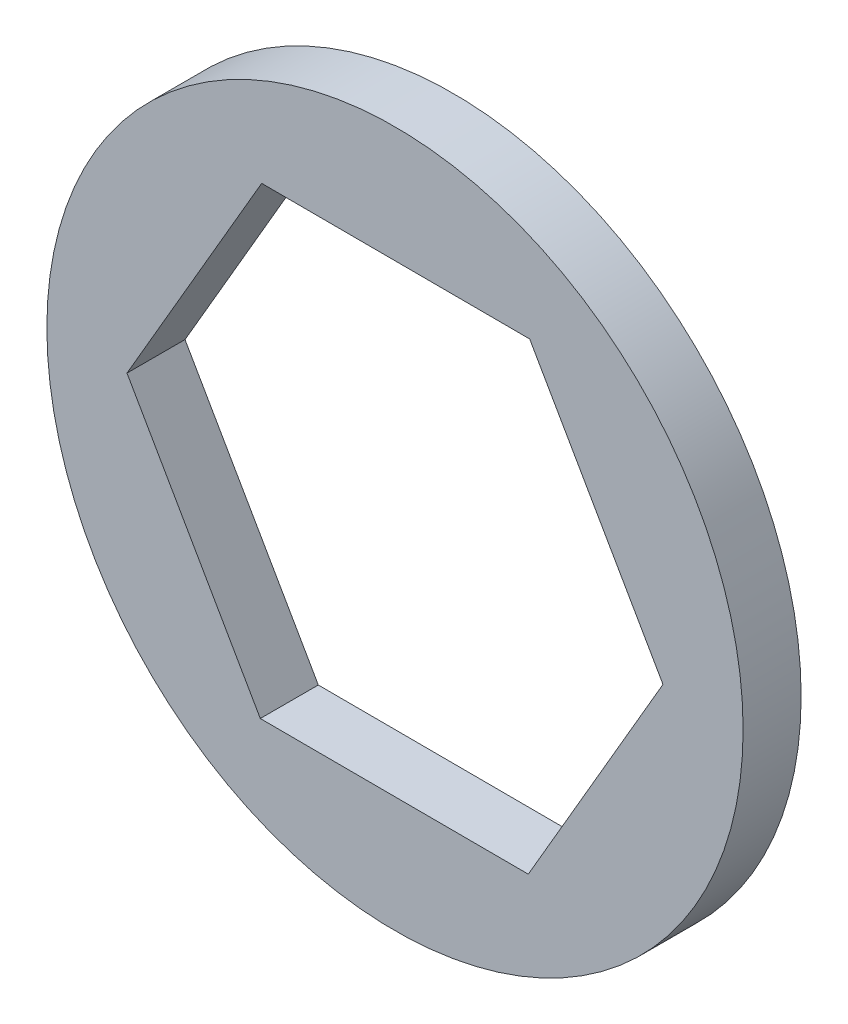
ISO-10303-21;
HEADER;
FILE_DESCRIPTION(('STEP AP214'),'2;1');
FILE_NAME('part.step','',(''),(''),'','','');
FILE_SCHEMA(('AUTOMOTIVE_DESIGN { 1 0 10303 214 1 1 1 1 }'));
ENDSEC;
DATA;
#1=APPLICATION_CONTEXT('core data for automotive mechanical design processes');
#2=APPLICATION_PROTOCOL_DEFINITION('international standard','automotive_design',2000,#1);
#3=PRODUCT_CONTEXT('',#1,'mechanical');
#4=PRODUCT('Part','Part','',(#3));
#5=PRODUCT_RELATED_PRODUCT_CATEGORY('part','',(#4));
#6=PRODUCT_DEFINITION_FORMATION('','',#4);
#7=PRODUCT_DEFINITION_CONTEXT('part definition',#1,'design');
#8=PRODUCT_DEFINITION('design','',#6,#7);
#9=PRODUCT_DEFINITION_SHAPE('','',#8);
#10=(LENGTH_UNIT() NAMED_UNIT(*) SI_UNIT(.MILLI.,.METRE.));
#11=(NAMED_UNIT(*) PLANE_ANGLE_UNIT() SI_UNIT($,.RADIAN.));
#12=(NAMED_UNIT(*) SI_UNIT($,.STERADIAN.) SOLID_ANGLE_UNIT());
#13=UNCERTAINTY_MEASURE_WITH_UNIT(LENGTH_MEASURE(1.E-05),#10,'distance_accuracy_value','');
#14=(GEOMETRIC_REPRESENTATION_CONTEXT(3) GLOBAL_UNCERTAINTY_ASSIGNED_CONTEXT((#13)) GLOBAL_UNIT_ASSIGNED_CONTEXT((#10,
#11,#12)) REPRESENTATION_CONTEXT('',''));
#15=CARTESIAN_POINT('',(0.,0.,0.));
#16=DIRECTION('',(0.,0.,1.));
#17=DIRECTION('',(1.,0.,0.));
#18=AXIS2_PLACEMENT_3D('',#15,#16,#17);
#19=CARTESIAN_POINT('',(0.,0.,1.5875));
#20=DIRECTION('',(0.,0.,1.));
#21=DIRECTION('',(1.,0.,0.));
#22=AXIS2_PLACEMENT_3D('',#19,#20,#21);
#23=PLANE('',#22);
#24=CARTESIAN_POINT('',(0.,0.,1.5875));
#25=DIRECTION('',(0.,0.,1.));
#26=DIRECTION('',(1.,0.,0.));
#27=AXIS2_PLACEMENT_3D('',#24,#25,#26);
#28=CIRCLE('',#27,9.525);
#29=CARTESIAN_POINT('',(9.525,0.,1.5875));
#30=VERTEX_POINT('',#29);
#31=EDGE_CURVE('E11',#30,#30,#28,.T.);
#32=ORIENTED_EDGE('',*,*,#31,.T.);
#33=EDGE_LOOP('',(#32));
#34=FACE_BOUND('',#33,.T.);
#35=DIRECTION('',(0.502611333572125,0.864512491156056,0.));
#36=VECTOR('',#35,1.);
#37=CARTESIAN_POINT('',(3.64699361036975,-6.36103536692381,1.5875));
#38=LINE('',#37,#36);
#39=CARTESIAN_POINT('',(3.64699361036975,-6.36103536692381,1.5875));
#40=VERTEX_POINT('',#39);
#41=CARTESIAN_POINT('',(7.33231502731217,-0.0221285694421737,1.5875));
#42=VERTEX_POINT('',#41);
#43=EDGE_CURVE('E100',#40,#42,#38,.T.);
#44=ORIENTED_EDGE('',*,*,#43,.F.);
#45=DIRECTION('',(0.999995446016177,-0.00301793752540637,0.));
#46=VECTOR('',#45,1.);
#47=CARTESIAN_POINT('',(-3.68532141694241,-6.33890679748164,1.5875));
#48=LINE('',#47,#46);
#49=CARTESIAN_POINT('',(-3.68532141694241,-6.33890679748164,1.5875));
#50=VERTEX_POINT('',#49);
#51=EDGE_CURVE('E92',#50,#40,#48,.T.);
#52=ORIENTED_EDGE('',*,*,#51,.F.);
#53=DIRECTION('',(0.497384112444053,-0.867530428681462,0.));
#54=VECTOR('',#53,1.);
#55=CARTESIAN_POINT('',(-7.33231502731217,0.022128569442172,1.5875));
#56=LINE('',#55,#54);
#57=CARTESIAN_POINT('',(-7.33231502731217,0.022128569442172,1.5875));
#58=VERTEX_POINT('',#57);
#59=EDGE_CURVE('E120',#58,#50,#56,.T.);
#60=ORIENTED_EDGE('',*,*,#59,.F.);
#61=DIRECTION('',(-0.502611333572125,-0.864512491156056,0.));
#62=VECTOR('',#61,1.);
#63=CARTESIAN_POINT('',(-3.64699361036976,6.36103536692381,1.5875));
#64=LINE('',#63,#62);
#65=CARTESIAN_POINT('',(-3.64699361036976,6.36103536692381,1.5875));
#66=VERTEX_POINT('',#65);
#67=EDGE_CURVE('E118',#66,#58,#64,.T.);
#68=ORIENTED_EDGE('',*,*,#67,.F.);
#69=DIRECTION('',(-0.999995446016177,0.00301793752540602,0.));
#70=VECTOR('',#69,1.);
#71=CARTESIAN_POINT('',(3.68532141694241,6.33890679748164,1.5875));
#72=LINE('',#71,#70);
#73=CARTESIAN_POINT('',(3.68532141694241,6.33890679748164,1.5875));
#74=VERTEX_POINT('',#73);
#75=EDGE_CURVE('E114',#74,#66,#72,.T.);
#76=ORIENTED_EDGE('',*,*,#75,.F.);
#77=DIRECTION('',(-0.497384112444053,0.867530428681462,0.));
#78=VECTOR('',#77,1.);
#79=CARTESIAN_POINT('',(7.33231502731217,-0.0221285694421737,1.5875));
#80=LINE('',#79,#78);
#81=EDGE_CURVE('E112',#42,#74,#80,.T.);
#82=ORIENTED_EDGE('',*,*,#81,.F.);
#83=EDGE_LOOP('',(#44,#52,#60,#68,#76,#82));
#84=FACE_BOUND('',#83,.T.);
#85=ADVANCED_FACE('F39',(#34,#84),#23,.T.);
#86=CARTESIAN_POINT('',(0.,0.,0.));
#87=DIRECTION('',(0.,0.,1.));
#88=DIRECTION('',(1.,0.,0.));
#89=AXIS2_PLACEMENT_3D('',#86,#87,#88);
#90=PLANE('',#89);
#91=CARTESIAN_POINT('',(0.,0.,0.));
#92=DIRECTION('',(0.,0.,1.));
#93=DIRECTION('',(1.,0.,0.));
#94=AXIS2_PLACEMENT_3D('',#91,#92,#93);
#95=CIRCLE('',#94,9.525);
#96=CARTESIAN_POINT('',(9.525,0.,0.));
#97=VERTEX_POINT('',#96);
#98=EDGE_CURVE('E43',#97,#97,#95,.T.);
#99=ORIENTED_EDGE('',*,*,#98,.F.);
#100=EDGE_LOOP('',(#99));
#101=FACE_BOUND('',#100,.T.);
#102=DIRECTION('',(0.999995446016177,-0.00301793752540637,0.));
#103=VECTOR('',#102,1.);
#104=CARTESIAN_POINT('',(-3.68532141694241,-6.33890679748164,0.));
#105=LINE('',#104,#103);
#106=CARTESIAN_POINT('',(-3.68532141694241,-6.33890679748164,0.));
#107=VERTEX_POINT('',#106);
#108=CARTESIAN_POINT('',(3.64699361036975,-6.36103536692381,0.));
#109=VERTEX_POINT('',#108);
#110=EDGE_CURVE('E62',#107,#109,#105,.T.);
#111=ORIENTED_EDGE('',*,*,#110,.T.);
#112=DIRECTION('',(0.502611333572125,0.864512491156056,0.));
#113=VECTOR('',#112,1.);
#114=CARTESIAN_POINT('',(3.64699361036975,-6.36103536692381,0.));
#115=LINE('',#114,#113);
#116=CARTESIAN_POINT('',(7.33231502731217,-0.0221285694421737,0.));
#117=VERTEX_POINT('',#116);
#118=EDGE_CURVE('E107',#109,#117,#115,.T.);
#119=ORIENTED_EDGE('',*,*,#118,.T.);
#120=DIRECTION('',(-0.497384112444053,0.867530428681462,0.));
#121=VECTOR('',#120,1.);
#122=CARTESIAN_POINT('',(7.33231502731217,-0.0221285694421737,0.));
#123=LINE('',#122,#121);
#124=CARTESIAN_POINT('',(3.68532141694241,6.33890679748164,0.));
#125=VERTEX_POINT('',#124);
#126=EDGE_CURVE('E124',#117,#125,#123,.T.);
#127=ORIENTED_EDGE('',*,*,#126,.T.);
#128=DIRECTION('',(-0.999995446016177,0.00301793752540602,0.));
#129=VECTOR('',#128,1.);
#130=CARTESIAN_POINT('',(3.68532141694241,6.33890679748164,0.));
#131=LINE('',#130,#129);
#132=CARTESIAN_POINT('',(-3.64699361036976,6.36103536692381,0.));
#133=VERTEX_POINT('',#132);
#134=EDGE_CURVE('E127',#125,#133,#131,.T.);
#135=ORIENTED_EDGE('',*,*,#134,.T.);
#136=DIRECTION('',(-0.502611333572125,-0.864512491156056,0.));
#137=VECTOR('',#136,1.);
#138=CARTESIAN_POINT('',(-3.64699361036976,6.36103536692381,0.));
#139=LINE('',#138,#137);
#140=CARTESIAN_POINT('',(-7.33231502731217,0.022128569442172,0.));
#141=VERTEX_POINT('',#140);
#142=EDGE_CURVE('E130',#133,#141,#139,.T.);
#143=ORIENTED_EDGE('',*,*,#142,.T.);
#144=DIRECTION('',(0.497384112444053,-0.867530428681462,0.));
#145=VECTOR('',#144,1.);
#146=CARTESIAN_POINT('',(-7.33231502731217,0.022128569442172,0.));
#147=LINE('',#146,#145);
#148=EDGE_CURVE('E101',#141,#107,#147,.T.);
#149=ORIENTED_EDGE('',*,*,#148,.T.);
#150=EDGE_LOOP('',(#111,#119,#127,#135,#143,#149));
#151=FACE_BOUND('',#150,.T.);
#152=ADVANCED_FACE('F147',(#101,#151),#90,.F.);
#153=CARTESIAN_POINT('',(0.,0.,1.5875));
#154=DIRECTION('',(0.,0.,-1.));
#155=DIRECTION('',(-1.,0.,0.));
#156=AXIS2_PLACEMENT_3D('',#153,#154,#155);
#157=CYLINDRICAL_SURFACE('',#156,9.525);
#158=ORIENTED_EDGE('',*,*,#31,.F.);
#159=EDGE_LOOP('',(#158));
#160=FACE_BOUND('',#159,.T.);
#161=ORIENTED_EDGE('',*,*,#98,.T.);
#162=EDGE_LOOP('',(#161));
#163=FACE_BOUND('',#162,.T.);
#164=ADVANCED_FACE('F41',(#160,#163),#157,.T.);
#165=CARTESIAN_POINT('',(-3.68532141694241,-6.33890679748164,1.5875));
#166=DIRECTION('',(0.00301793752540637,0.999995446016177,0.));
#167=DIRECTION('',(-0.999995446016177,0.00301793752540637,0.));
#168=AXIS2_PLACEMENT_3D('',#165,#166,#167);
#169=PLANE('',#168);
#170=ORIENTED_EDGE('',*,*,#110,.F.);
#171=DIRECTION('',(0.,0.,-1.));
#172=VECTOR('',#171,1.);
#173=CARTESIAN_POINT('',(-3.68532141694241,-6.33890679748164,1.5875));
#174=LINE('',#173,#172);
#175=EDGE_CURVE('E96',#50,#107,#174,.T.);
#176=ORIENTED_EDGE('',*,*,#175,.F.);
#177=ORIENTED_EDGE('',*,*,#51,.T.);
#178=DIRECTION('',(0.,0.,-1.));
#179=VECTOR('',#178,1.);
#180=CARTESIAN_POINT('',(3.64699361036975,-6.36103536692381,1.5875));
#181=LINE('',#180,#179);
#182=EDGE_CURVE('E95',#40,#109,#181,.T.);
#183=ORIENTED_EDGE('',*,*,#182,.T.);
#184=EDGE_LOOP('',(#170,#176,#177,#183));
#185=FACE_BOUND('',#184,.T.);
#186=ADVANCED_FACE('F94',(#185),#169,.T.);
#187=CARTESIAN_POINT('',(3.64699361036975,-6.36103536692381,1.5875));
#188=DIRECTION('',(-0.864512491156056,0.502611333572125,0.));
#189=DIRECTION('',(-0.502611333572125,-0.864512491156056,0.));
#190=AXIS2_PLACEMENT_3D('',#187,#188,#189);
#191=PLANE('',#190);
#192=ORIENTED_EDGE('',*,*,#118,.F.);
#193=ORIENTED_EDGE('',*,*,#182,.F.);
#194=ORIENTED_EDGE('',*,*,#43,.T.);
#195=DIRECTION('',(0.,0.,-1.));
#196=VECTOR('',#195,1.);
#197=CARTESIAN_POINT('',(7.33231502731217,-0.0221285694421737,1.5875));
#198=LINE('',#197,#196);
#199=EDGE_CURVE('E108',#42,#117,#198,.T.);
#200=ORIENTED_EDGE('',*,*,#199,.T.);
#201=EDGE_LOOP('',(#192,#193,#194,#200));
#202=FACE_BOUND('',#201,.T.);
#203=ADVANCED_FACE('F104',(#202),#191,.T.);
#204=CARTESIAN_POINT('',(7.33231502731217,-0.0221285694421737,1.5875));
#205=DIRECTION('',(-0.867530428681462,-0.497384112444053,0.));
#206=DIRECTION('',(0.497384112444053,-0.867530428681462,0.));
#207=AXIS2_PLACEMENT_3D('',#204,#205,#206);
#208=PLANE('',#207);
#209=ORIENTED_EDGE('',*,*,#126,.F.);
#210=ORIENTED_EDGE('',*,*,#199,.F.);
#211=ORIENTED_EDGE('',*,*,#81,.T.);
#212=DIRECTION('',(0.,0.,-1.));
#213=VECTOR('',#212,1.);
#214=CARTESIAN_POINT('',(3.68532141694241,6.33890679748164,1.5875));
#215=LINE('',#214,#213);
#216=EDGE_CURVE('E139',#74,#125,#215,.T.);
#217=ORIENTED_EDGE('',*,*,#216,.T.);
#218=EDGE_LOOP('',(#209,#210,#211,#217));
#219=FACE_BOUND('',#218,.T.);
#220=ADVANCED_FACE('F143',(#219),#208,.T.);
#221=CARTESIAN_POINT('',(3.68532141694241,6.33890679748164,1.5875));
#222=DIRECTION('',(-0.00301793752540602,-0.999995446016177,0.));
#223=DIRECTION('',(0.999995446016177,-0.00301793752540602,0.));
#224=AXIS2_PLACEMENT_3D('',#221,#222,#223);
#225=PLANE('',#224);
#226=ORIENTED_EDGE('',*,*,#134,.F.);
#227=ORIENTED_EDGE('',*,*,#216,.F.);
#228=ORIENTED_EDGE('',*,*,#75,.T.);
#229=DIRECTION('',(0.,0.,-1.));
#230=VECTOR('',#229,1.);
#231=CARTESIAN_POINT('',(-3.64699361036976,6.36103536692381,1.5875));
#232=LINE('',#231,#230);
#233=EDGE_CURVE('E137',#66,#133,#232,.T.);
#234=ORIENTED_EDGE('',*,*,#233,.T.);
#235=EDGE_LOOP('',(#226,#227,#228,#234));
#236=FACE_BOUND('',#235,.T.);
#237=ADVANCED_FACE('F155',(#236),#225,.T.);
#238=CARTESIAN_POINT('',(-3.64699361036976,6.36103536692381,1.5875));
#239=DIRECTION('',(0.864512491156056,-0.502611333572125,0.));
#240=DIRECTION('',(0.502611333572125,0.864512491156056,0.));
#241=AXIS2_PLACEMENT_3D('',#238,#239,#240);
#242=PLANE('',#241);
#243=ORIENTED_EDGE('',*,*,#142,.F.);
#244=ORIENTED_EDGE('',*,*,#233,.F.);
#245=ORIENTED_EDGE('',*,*,#67,.T.);
#246=DIRECTION('',(0.,0.,-1.));
#247=VECTOR('',#246,1.);
#248=CARTESIAN_POINT('',(-7.33231502731217,0.022128569442172,1.5875));
#249=LINE('',#248,#247);
#250=EDGE_CURVE('E54',#58,#141,#249,.T.);
#251=ORIENTED_EDGE('',*,*,#250,.T.);
#252=EDGE_LOOP('',(#243,#244,#245,#251));
#253=FACE_BOUND('',#252,.T.);
#254=ADVANCED_FACE('F153',(#253),#242,.T.);
#255=CARTESIAN_POINT('',(-7.33231502731217,0.022128569442172,1.5875));
#256=DIRECTION('',(0.867530428681462,0.497384112444053,0.));
#257=DIRECTION('',(-0.497384112444053,0.867530428681462,0.));
#258=AXIS2_PLACEMENT_3D('',#255,#256,#257);
#259=PLANE('',#258);
#260=ORIENTED_EDGE('',*,*,#148,.F.);
#261=ORIENTED_EDGE('',*,*,#250,.F.);
#262=ORIENTED_EDGE('',*,*,#59,.T.);
#263=ORIENTED_EDGE('',*,*,#175,.T.);
#264=EDGE_LOOP('',(#260,#261,#262,#263));
#265=FACE_BOUND('',#264,.T.);
#266=ADVANCED_FACE('F149',(#265),#259,.T.);
#267=CLOSED_SHELL('',(#85,#152,#164,#186,#203,#220,#237,#254,#266));
#268=MANIFOLD_SOLID_BREP('B2',#267);
#269=ADVANCED_BREP_SHAPE_REPRESENTATION('',(#18,#268),#14);
#270=SHAPE_DEFINITION_REPRESENTATION(#9,#269);
ENDSEC;
END-ISO-10303-21;
